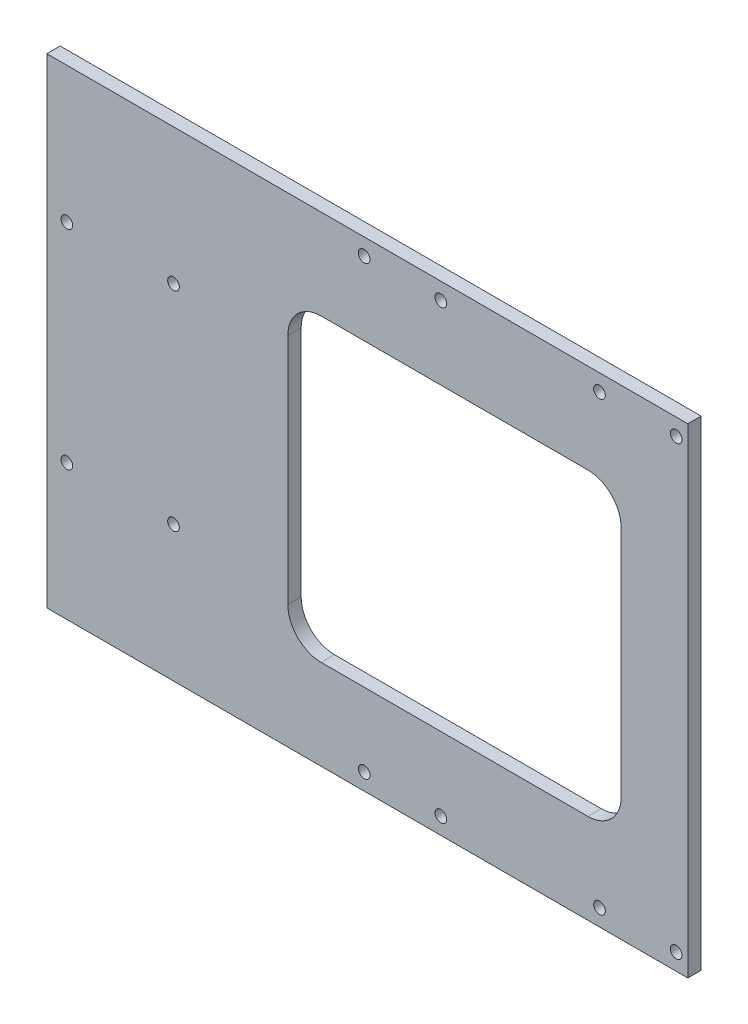
ISO-10303-21;
HEADER;
FILE_DESCRIPTION(('STEP AP214'),'2;1');
FILE_NAME('part.step','',(''),(''),'','','');
FILE_SCHEMA(('AUTOMOTIVE_DESIGN { 1 0 10303 214 1 1 1 1 }'));
ENDSEC;
DATA;
#1=APPLICATION_CONTEXT('core data for automotive mechanical design processes');
#2=APPLICATION_PROTOCOL_DEFINITION('international standard','automotive_design',2000,#1);
#3=PRODUCT_CONTEXT('',#1,'mechanical');
#4=PRODUCT('Part','Part','',(#3));
#5=PRODUCT_RELATED_PRODUCT_CATEGORY('part','',(#4));
#6=PRODUCT_DEFINITION_FORMATION('','',#4);
#7=PRODUCT_DEFINITION_CONTEXT('part definition',#1,'design');
#8=PRODUCT_DEFINITION('design','',#6,#7);
#9=PRODUCT_DEFINITION_SHAPE('','',#8);
#10=(LENGTH_UNIT() NAMED_UNIT(*) SI_UNIT(.MILLI.,.METRE.));
#11=(NAMED_UNIT(*) PLANE_ANGLE_UNIT() SI_UNIT($,.RADIAN.));
#12=(NAMED_UNIT(*) SI_UNIT($,.STERADIAN.) SOLID_ANGLE_UNIT());
#13=UNCERTAINTY_MEASURE_WITH_UNIT(LENGTH_MEASURE(1.E-05),#10,'distance_accuracy_value','');
#14=(GEOMETRIC_REPRESENTATION_CONTEXT(3) GLOBAL_UNCERTAINTY_ASSIGNED_CONTEXT((#13)) GLOBAL_UNIT_ASSIGNED_CONTEXT((#10,
#11,#12)) REPRESENTATION_CONTEXT('',''));
#15=CARTESIAN_POINT('',(0.,0.,0.));
#16=DIRECTION('',(0.,0.,1.));
#17=DIRECTION('',(1.,0.,0.));
#18=AXIS2_PLACEMENT_3D('',#15,#16,#17);
#19=CARTESIAN_POINT('',(-96.15,0.,4.));
#20=DIRECTION('',(-1.,0.,0.));
#21=DIRECTION('',(0.,0.,1.));
#22=AXIS2_PLACEMENT_3D('',#19,#20,#21);
#23=PLANE('',#22);
#24=DIRECTION('',(0.,1.,0.));
#25=VECTOR('',#24,1.);
#26=CARTESIAN_POINT('',(-96.15,0.,0.));
#27=LINE('',#26,#25);
#28=CARTESIAN_POINT('',(-96.15,-72.,0.));
#29=VERTEX_POINT('',#28);
#30=CARTESIAN_POINT('',(-96.15,72.,0.));
#31=VERTEX_POINT('',#30);
#32=EDGE_CURVE('E128',#29,#31,#27,.T.);
#33=ORIENTED_EDGE('',*,*,#32,.F.);
#34=DIRECTION('',(0.,0.,-1.));
#35=VECTOR('',#34,1.);
#36=CARTESIAN_POINT('',(-96.15,-72.,4.));
#37=LINE('',#36,#35);
#38=CARTESIAN_POINT('',(-96.15,-72.,4.));
#39=VERTEX_POINT('',#38);
#40=EDGE_CURVE('E124',#39,#29,#37,.T.);
#41=ORIENTED_EDGE('',*,*,#40,.F.);
#42=DIRECTION('',(0.,1.,0.));
#43=VECTOR('',#42,1.);
#44=CARTESIAN_POINT('',(-96.15,0.,4.));
#45=LINE('',#44,#43);
#46=CARTESIAN_POINT('',(-96.15,72.,4.));
#47=VERTEX_POINT('',#46);
#48=EDGE_CURVE('E126',#39,#47,#45,.T.);
#49=ORIENTED_EDGE('',*,*,#48,.T.);
#50=DIRECTION('',(0.,0.,-1.));
#51=VECTOR('',#50,1.);
#52=CARTESIAN_POINT('',(-96.15,72.,4.));
#53=LINE('',#52,#51);
#54=EDGE_CURVE('E172',#47,#31,#53,.T.);
#55=ORIENTED_EDGE('',*,*,#54,.T.);
#56=EDGE_LOOP('',(#33,#41,#49,#55));
#57=FACE_BOUND('',#56,.T.);
#58=ADVANCED_FACE('F34',(#57),#23,.T.);
#59=CARTESIAN_POINT('',(0.,-72.,4.));
#60=DIRECTION('',(0.,-1.,0.));
#61=DIRECTION('',(1.,0.,0.));
#62=AXIS2_PLACEMENT_3D('',#59,#60,#61);
#63=PLANE('',#62);
#64=DIRECTION('',(-1.,0.,0.));
#65=VECTOR('',#64,1.);
#66=CARTESIAN_POINT('',(0.,-72.,0.));
#67=LINE('',#66,#65);
#68=CARTESIAN_POINT('',(96.15,-72.,0.));
#69=VERTEX_POINT('',#68);
#70=EDGE_CURVE('E193',#69,#29,#67,.T.);
#71=ORIENTED_EDGE('',*,*,#70,.F.);
#72=DIRECTION('',(0.,0.,-1.));
#73=VECTOR('',#72,1.);
#74=CARTESIAN_POINT('',(96.15,-72.,4.));
#75=LINE('',#74,#73);
#76=CARTESIAN_POINT('',(96.15,-72.,4.));
#77=VERTEX_POINT('',#76);
#78=EDGE_CURVE('E134',#77,#69,#75,.T.);
#79=ORIENTED_EDGE('',*,*,#78,.F.);
#80=DIRECTION('',(-1.,0.,0.));
#81=VECTOR('',#80,1.);
#82=CARTESIAN_POINT('',(0.,-72.,4.));
#83=LINE('',#82,#81);
#84=EDGE_CURVE('E141',#77,#39,#83,.T.);
#85=ORIENTED_EDGE('',*,*,#84,.T.);
#86=ORIENTED_EDGE('',*,*,#40,.T.);
#87=EDGE_LOOP('',(#71,#79,#85,#86));
#88=FACE_BOUND('',#87,.T.);
#89=ADVANCED_FACE('F146',(#88),#63,.T.);
#90=CARTESIAN_POINT('',(96.15,0.,4.));
#91=DIRECTION('',(-1.,0.,0.));
#92=DIRECTION('',(0.,0.,1.));
#93=AXIS2_PLACEMENT_3D('',#90,#91,#92);
#94=PLANE('',#93);
#95=DIRECTION('',(0.,1.,0.));
#96=VECTOR('',#95,1.);
#97=CARTESIAN_POINT('',(96.15,0.,0.));
#98=LINE('',#97,#96);
#99=CARTESIAN_POINT('',(96.15,72.,0.));
#100=VERTEX_POINT('',#99);
#101=EDGE_CURVE('E195',#69,#100,#98,.T.);
#102=ORIENTED_EDGE('',*,*,#101,.T.);
#103=DIRECTION('',(0.,0.,-1.));
#104=VECTOR('',#103,1.);
#105=CARTESIAN_POINT('',(96.15,72.,4.));
#106=LINE('',#105,#104);
#107=CARTESIAN_POINT('',(96.15,72.,4.));
#108=VERTEX_POINT('',#107);
#109=EDGE_CURVE('E221',#108,#100,#106,.T.);
#110=ORIENTED_EDGE('',*,*,#109,.F.);
#111=DIRECTION('',(0.,1.,0.));
#112=VECTOR('',#111,1.);
#113=CARTESIAN_POINT('',(96.15,0.,4.));
#114=LINE('',#113,#112);
#115=EDGE_CURVE('E148',#77,#108,#114,.T.);
#116=ORIENTED_EDGE('',*,*,#115,.F.);
#117=ORIENTED_EDGE('',*,*,#78,.T.);
#118=EDGE_LOOP('',(#102,#110,#116,#117));
#119=FACE_BOUND('',#118,.T.);
#120=ADVANCED_FACE('F345',(#119),#94,.F.);
#121=CARTESIAN_POINT('',(92.65,-67.,4.));
#122=DIRECTION('',(0.,0.,-1.));
#123=DIRECTION('',(-1.,0.,0.));
#124=AXIS2_PLACEMENT_3D('',#121,#122,#123);
#125=CYLINDRICAL_SURFACE('',#124,1.75);
#126=CARTESIAN_POINT('',(92.65,-67.,4.));
#127=DIRECTION('',(0.,0.,1.));
#128=DIRECTION('',(1.,0.,0.));
#129=AXIS2_PLACEMENT_3D('',#126,#127,#128);
#130=CIRCLE('',#129,1.75);
#131=CARTESIAN_POINT('',(94.4,-67.,4.));
#132=VERTEX_POINT('',#131);
#133=EDGE_CURVE('E166',#132,#132,#130,.F.);
#134=ORIENTED_EDGE('',*,*,#133,.F.);
#135=EDGE_LOOP('',(#134));
#136=FACE_BOUND('',#135,.T.);
#137=CARTESIAN_POINT('',(92.65,-67.,0.));
#138=DIRECTION('',(0.,0.,1.));
#139=DIRECTION('',(1.,0.,0.));
#140=AXIS2_PLACEMENT_3D('',#137,#138,#139);
#141=CIRCLE('',#140,1.75);
#142=CARTESIAN_POINT('',(94.4,-67.,0.));
#143=VERTEX_POINT('',#142);
#144=EDGE_CURVE('E213',#143,#143,#141,.F.);
#145=ORIENTED_EDGE('',*,*,#144,.T.);
#146=EDGE_LOOP('',(#145));
#147=FACE_BOUND('',#146,.T.);
#148=ADVANCED_FACE('F530',(#136,#147),#125,.F.);
#149=CARTESIAN_POINT('',(22.05,-66.9999999999999,4.));
#150=DIRECTION('',(0.,0.,-1.));
#151=DIRECTION('',(-1.,0.,0.));
#152=AXIS2_PLACEMENT_3D('',#149,#150,#151);
#153=CYLINDRICAL_SURFACE('',#152,1.75);
#154=CARTESIAN_POINT('',(22.05,-66.9999999999999,4.));
#155=DIRECTION('',(0.,0.,1.));
#156=DIRECTION('',(1.,0.,0.));
#157=AXIS2_PLACEMENT_3D('',#154,#155,#156);
#158=CIRCLE('',#157,1.75);
#159=CARTESIAN_POINT('',(23.8,-66.9999999999999,4.));
#160=VERTEX_POINT('',#159);
#161=EDGE_CURVE('E163',#160,#160,#158,.F.);
#162=ORIENTED_EDGE('',*,*,#161,.F.);
#163=EDGE_LOOP('',(#162));
#164=FACE_BOUND('',#163,.T.);
#165=CARTESIAN_POINT('',(22.05,-66.9999999999999,0.));
#166=DIRECTION('',(0.,0.,1.));
#167=DIRECTION('',(1.,0.,0.));
#168=AXIS2_PLACEMENT_3D('',#165,#166,#167);
#169=CIRCLE('',#168,1.75);
#170=CARTESIAN_POINT('',(23.8,-66.9999999999999,0.));
#171=VERTEX_POINT('',#170);
#172=EDGE_CURVE('E210',#171,#171,#169,.F.);
#173=ORIENTED_EDGE('',*,*,#172,.T.);
#174=EDGE_LOOP('',(#173));
#175=FACE_BOUND('',#174,.T.);
#176=ADVANCED_FACE('F520',(#164,#175),#153,.F.);
#177=CARTESIAN_POINT('',(-0.950000000000013,-66.9999999999999,4.));
#178=DIRECTION('',(0.,0.,-1.));
#179=DIRECTION('',(-1.,0.,0.));
#180=AXIS2_PLACEMENT_3D('',#177,#178,#179);
#181=CYLINDRICAL_SURFACE('',#180,1.75);
#182=CARTESIAN_POINT('',(-0.950000000000013,-66.9999999999999,4.));
#183=DIRECTION('',(0.,0.,1.));
#184=DIRECTION('',(1.,0.,0.));
#185=AXIS2_PLACEMENT_3D('',#182,#183,#184);
#186=CIRCLE('',#185,1.75);
#187=CARTESIAN_POINT('',(0.799999999999988,-66.9999999999999,4.));
#188=VERTEX_POINT('',#187);
#189=EDGE_CURVE('E160',#188,#188,#186,.F.);
#190=ORIENTED_EDGE('',*,*,#189,.F.);
#191=EDGE_LOOP('',(#190));
#192=FACE_BOUND('',#191,.T.);
#193=CARTESIAN_POINT('',(-0.950000000000013,-66.9999999999999,0.));
#194=DIRECTION('',(0.,0.,1.));
#195=DIRECTION('',(1.,0.,0.));
#196=AXIS2_PLACEMENT_3D('',#193,#194,#195);
#197=CIRCLE('',#196,1.75);
#198=CARTESIAN_POINT('',(0.799999999999988,-66.9999999999999,0.));
#199=VERTEX_POINT('',#198);
#200=EDGE_CURVE('E207',#199,#199,#197,.F.);
#201=ORIENTED_EDGE('',*,*,#200,.T.);
#202=EDGE_LOOP('',(#201));
#203=FACE_BOUND('',#202,.T.);
#204=ADVANCED_FACE('F510',(#192,#203),#181,.F.);
#205=CARTESIAN_POINT('',(69.65,-67.,4.));
#206=DIRECTION('',(0.,0.,-1.));
#207=DIRECTION('',(-1.,0.,0.));
#208=AXIS2_PLACEMENT_3D('',#205,#206,#207);
#209=CYLINDRICAL_SURFACE('',#208,1.75);
#210=CARTESIAN_POINT('',(69.65,-67.,4.));
#211=DIRECTION('',(0.,0.,1.));
#212=DIRECTION('',(1.,0.,0.));
#213=AXIS2_PLACEMENT_3D('',#210,#211,#212);
#214=CIRCLE('',#213,1.75);
#215=CARTESIAN_POINT('',(71.4,-67.,4.));
#216=VERTEX_POINT('',#215);
#217=EDGE_CURVE('E157',#216,#216,#214,.F.);
#218=ORIENTED_EDGE('',*,*,#217,.F.);
#219=EDGE_LOOP('',(#218));
#220=FACE_BOUND('',#219,.T.);
#221=CARTESIAN_POINT('',(69.65,-67.,0.));
#222=DIRECTION('',(0.,0.,1.));
#223=DIRECTION('',(1.,0.,0.));
#224=AXIS2_PLACEMENT_3D('',#221,#222,#223);
#225=CIRCLE('',#224,1.75);
#226=CARTESIAN_POINT('',(71.4,-67.,0.));
#227=VERTEX_POINT('',#226);
#228=EDGE_CURVE('E204',#227,#227,#225,.F.);
#229=ORIENTED_EDGE('',*,*,#228,.T.);
#230=EDGE_LOOP('',(#229));
#231=FACE_BOUND('',#230,.T.);
#232=ADVANCED_FACE('F500',(#220,#231),#209,.F.);
#233=CARTESIAN_POINT('',(-90.15,-31.25,4.));
#234=DIRECTION('',(0.,0.,-1.));
#235=DIRECTION('',(-1.,0.,0.));
#236=AXIS2_PLACEMENT_3D('',#233,#234,#235);
#237=CYLINDRICAL_SURFACE('',#236,1.75);
#238=CARTESIAN_POINT('',(-90.15,-31.25,4.));
#239=DIRECTION('',(0.,0.,1.));
#240=DIRECTION('',(1.,0.,0.));
#241=AXIS2_PLACEMENT_3D('',#238,#239,#240);
#242=CIRCLE('',#241,1.75);
#243=CARTESIAN_POINT('',(-88.4,-31.25,4.));
#244=VERTEX_POINT('',#243);
#245=EDGE_CURVE('E154',#244,#244,#242,.F.);
#246=ORIENTED_EDGE('',*,*,#245,.F.);
#247=EDGE_LOOP('',(#246));
#248=FACE_BOUND('',#247,.T.);
#249=CARTESIAN_POINT('',(-90.15,-31.25,0.));
#250=DIRECTION('',(0.,0.,1.));
#251=DIRECTION('',(1.,0.,0.));
#252=AXIS2_PLACEMENT_3D('',#249,#250,#251);
#253=CIRCLE('',#252,1.75);
#254=CARTESIAN_POINT('',(-88.4,-31.25,0.));
#255=VERTEX_POINT('',#254);
#256=EDGE_CURVE('E201',#255,#255,#253,.F.);
#257=ORIENTED_EDGE('',*,*,#256,.T.);
#258=EDGE_LOOP('',(#257));
#259=FACE_BOUND('',#258,.T.);
#260=ADVANCED_FACE('F490',(#248,#259),#237,.F.);
#261=CARTESIAN_POINT('',(0.,72.,4.));
#262=DIRECTION('',(0.,-1.,0.));
#263=DIRECTION('',(1.,0.,0.));
#264=AXIS2_PLACEMENT_3D('',#261,#262,#263);
#265=PLANE('',#264);
#266=DIRECTION('',(-1.,0.,0.));
#267=VECTOR('',#266,1.);
#268=CARTESIAN_POINT('',(0.,72.,0.));
#269=LINE('',#268,#267);
#270=EDGE_CURVE('E198',#100,#31,#269,.T.);
#271=ORIENTED_EDGE('',*,*,#270,.T.);
#272=ORIENTED_EDGE('',*,*,#54,.F.);
#273=DIRECTION('',(-1.,0.,0.));
#274=VECTOR('',#273,1.);
#275=CARTESIAN_POINT('',(0.,72.,4.));
#276=LINE('',#275,#274);
#277=EDGE_CURVE('E142',#108,#47,#276,.T.);
#278=ORIENTED_EDGE('',*,*,#277,.F.);
#279=ORIENTED_EDGE('',*,*,#109,.T.);
#280=EDGE_LOOP('',(#271,#272,#278,#279));
#281=FACE_BOUND('',#280,.T.);
#282=ADVANCED_FACE('F352',(#281),#265,.F.);
#283=CARTESIAN_POINT('',(92.65,67.,4.));
#284=DIRECTION('',(0.,0.,-1.));
#285=DIRECTION('',(-1.,0.,0.));
#286=AXIS2_PLACEMENT_3D('',#283,#284,#285);
#287=CYLINDRICAL_SURFACE('',#286,1.75);
#288=CARTESIAN_POINT('',(92.65,67.,4.));
#289=DIRECTION('',(0.,0.,1.));
#290=DIRECTION('',(1.,0.,0.));
#291=AXIS2_PLACEMENT_3D('',#288,#289,#290);
#292=CIRCLE('',#291,1.75);
#293=CARTESIAN_POINT('',(94.4,67.,4.));
#294=VERTEX_POINT('',#293);
#295=EDGE_CURVE('E144',#294,#294,#292,.T.);
#296=ORIENTED_EDGE('',*,*,#295,.T.);
#297=EDGE_LOOP('',(#296));
#298=FACE_BOUND('',#297,.T.);
#299=CARTESIAN_POINT('',(92.65,67.,0.));
#300=DIRECTION('',(0.,0.,1.));
#301=DIRECTION('',(1.,0.,0.));
#302=AXIS2_PLACEMENT_3D('',#299,#300,#301);
#303=CIRCLE('',#302,1.75);
#304=CARTESIAN_POINT('',(94.4,67.,0.));
#305=VERTEX_POINT('',#304);
#306=EDGE_CURVE('E189',#305,#305,#303,.T.);
#307=ORIENTED_EDGE('',*,*,#306,.F.);
#308=EDGE_LOOP('',(#307));
#309=FACE_BOUND('',#308,.T.);
#310=ADVANCED_FACE('F325',(#298,#309),#287,.F.);
#311=CARTESIAN_POINT('',(69.65,67.,4.));
#312=DIRECTION('',(0.,0.,-1.));
#313=DIRECTION('',(-1.,0.,0.));
#314=AXIS2_PLACEMENT_3D('',#311,#312,#313);
#315=CYLINDRICAL_SURFACE('',#314,1.75);
#316=CARTESIAN_POINT('',(69.65,67.,4.));
#317=DIRECTION('',(0.,0.,1.));
#318=DIRECTION('',(1.,0.,0.));
#319=AXIS2_PLACEMENT_3D('',#316,#317,#318);
#320=CIRCLE('',#319,1.75);
#321=CARTESIAN_POINT('',(71.4,67.,4.));
#322=VERTEX_POINT('',#321);
#323=EDGE_CURVE('E320',#322,#322,#320,.T.);
#324=ORIENTED_EDGE('',*,*,#323,.T.);
#325=EDGE_LOOP('',(#324));
#326=FACE_BOUND('',#325,.T.);
#327=CARTESIAN_POINT('',(69.65,67.,0.));
#328=DIRECTION('',(0.,0.,1.));
#329=DIRECTION('',(1.,0.,0.));
#330=AXIS2_PLACEMENT_3D('',#327,#328,#329);
#331=CIRCLE('',#330,1.75);
#332=CARTESIAN_POINT('',(71.4,67.,0.));
#333=VERTEX_POINT('',#332);
#334=EDGE_CURVE('E186',#333,#333,#331,.T.);
#335=ORIENTED_EDGE('',*,*,#334,.F.);
#336=EDGE_LOOP('',(#335));
#337=FACE_BOUND('',#336,.T.);
#338=ADVANCED_FACE('F351',(#326,#337),#315,.F.);
#339=CARTESIAN_POINT('',(22.05,66.9999999999999,4.));
#340=DIRECTION('',(0.,0.,-1.));
#341=DIRECTION('',(-1.,0.,0.));
#342=AXIS2_PLACEMENT_3D('',#339,#340,#341);
#343=CYLINDRICAL_SURFACE('',#342,1.75);
#344=CARTESIAN_POINT('',(22.05,66.9999999999999,4.));
#345=DIRECTION('',(0.,0.,1.));
#346=DIRECTION('',(1.,0.,0.));
#347=AXIS2_PLACEMENT_3D('',#344,#345,#346);
#348=CIRCLE('',#347,1.75);
#349=CARTESIAN_POINT('',(23.8,66.9999999999999,4.));
#350=VERTEX_POINT('',#349);
#351=EDGE_CURVE('E317',#350,#350,#348,.T.);
#352=ORIENTED_EDGE('',*,*,#351,.T.);
#353=EDGE_LOOP('',(#352));
#354=FACE_BOUND('',#353,.T.);
#355=CARTESIAN_POINT('',(22.05,66.9999999999999,0.));
#356=DIRECTION('',(0.,0.,1.));
#357=DIRECTION('',(1.,0.,0.));
#358=AXIS2_PLACEMENT_3D('',#355,#356,#357);
#359=CIRCLE('',#358,1.75);
#360=CARTESIAN_POINT('',(23.8,66.9999999999999,0.));
#361=VERTEX_POINT('',#360);
#362=EDGE_CURVE('E183',#361,#361,#359,.T.);
#363=ORIENTED_EDGE('',*,*,#362,.F.);
#364=EDGE_LOOP('',(#363));
#365=FACE_BOUND('',#364,.T.);
#366=ADVANCED_FACE('F355',(#354,#365),#343,.F.);
#367=CARTESIAN_POINT('',(-0.950000000000013,66.9999999999999,4.));
#368=DIRECTION('',(0.,0.,-1.));
#369=DIRECTION('',(-1.,0.,0.));
#370=AXIS2_PLACEMENT_3D('',#367,#368,#369);
#371=CYLINDRICAL_SURFACE('',#370,1.75);
#372=CARTESIAN_POINT('',(-0.950000000000013,66.9999999999999,4.));
#373=DIRECTION('',(0.,0.,1.));
#374=DIRECTION('',(1.,0.,0.));
#375=AXIS2_PLACEMENT_3D('',#372,#373,#374);
#376=CIRCLE('',#375,1.75);
#377=CARTESIAN_POINT('',(0.799999999999988,66.9999999999999,4.));
#378=VERTEX_POINT('',#377);
#379=EDGE_CURVE('E314',#378,#378,#376,.T.);
#380=ORIENTED_EDGE('',*,*,#379,.T.);
#381=EDGE_LOOP('',(#380));
#382=FACE_BOUND('',#381,.T.);
#383=CARTESIAN_POINT('',(-0.950000000000013,66.9999999999999,0.));
#384=DIRECTION('',(0.,0.,1.));
#385=DIRECTION('',(1.,0.,0.));
#386=AXIS2_PLACEMENT_3D('',#383,#384,#385);
#387=CIRCLE('',#386,1.75);
#388=CARTESIAN_POINT('',(0.799999999999988,66.9999999999999,0.));
#389=VERTEX_POINT('',#388);
#390=EDGE_CURVE('E180',#389,#389,#387,.T.);
#391=ORIENTED_EDGE('',*,*,#390,.F.);
#392=EDGE_LOOP('',(#391));
#393=FACE_BOUND('',#392,.T.);
#394=ADVANCED_FACE('F359',(#382,#393),#371,.F.);
#395=CARTESIAN_POINT('',(-90.15,31.25,4.));
#396=DIRECTION('',(0.,0.,-1.));
#397=DIRECTION('',(-1.,0.,0.));
#398=AXIS2_PLACEMENT_3D('',#395,#396,#397);
#399=CYLINDRICAL_SURFACE('',#398,1.75);
#400=CARTESIAN_POINT('',(-90.15,31.25,4.));
#401=DIRECTION('',(0.,0.,1.));
#402=DIRECTION('',(1.,0.,0.));
#403=AXIS2_PLACEMENT_3D('',#400,#401,#402);
#404=CIRCLE('',#403,1.75);
#405=CARTESIAN_POINT('',(-88.4,31.25,4.));
#406=VERTEX_POINT('',#405);
#407=EDGE_CURVE('E311',#406,#406,#404,.T.);
#408=ORIENTED_EDGE('',*,*,#407,.T.);
#409=EDGE_LOOP('',(#408));
#410=FACE_BOUND('',#409,.T.);
#411=CARTESIAN_POINT('',(-90.15,31.25,0.));
#412=DIRECTION('',(0.,0.,1.));
#413=DIRECTION('',(1.,0.,0.));
#414=AXIS2_PLACEMENT_3D('',#411,#412,#413);
#415=CIRCLE('',#414,1.75);
#416=CARTESIAN_POINT('',(-88.4,31.25,0.));
#417=VERTEX_POINT('',#416);
#418=EDGE_CURVE('E176',#417,#417,#415,.T.);
#419=ORIENTED_EDGE('',*,*,#418,.F.);
#420=EDGE_LOOP('',(#419));
#421=FACE_BOUND('',#420,.T.);
#422=ADVANCED_FACE('F363',(#410,#421),#399,.F.);
#423=CARTESIAN_POINT('',(-58.15,31.25,4.));
#424=DIRECTION('',(0.,0.,-1.));
#425=DIRECTION('',(-1.,0.,0.));
#426=AXIS2_PLACEMENT_3D('',#423,#424,#425);
#427=CYLINDRICAL_SURFACE('',#426,1.75);
#428=CARTESIAN_POINT('',(-58.15,31.25,4.));
#429=DIRECTION('',(0.,0.,1.));
#430=DIRECTION('',(1.,0.,0.));
#431=AXIS2_PLACEMENT_3D('',#428,#429,#430);
#432=CIRCLE('',#431,1.75);
#433=CARTESIAN_POINT('',(-56.4,31.25,4.));
#434=VERTEX_POINT('',#433);
#435=EDGE_CURVE('E219',#434,#434,#432,.T.);
#436=ORIENTED_EDGE('',*,*,#435,.T.);
#437=EDGE_LOOP('',(#436));
#438=FACE_BOUND('',#437,.T.);
#439=CARTESIAN_POINT('',(-58.15,31.25,0.));
#440=DIRECTION('',(0.,0.,1.));
#441=DIRECTION('',(1.,0.,0.));
#442=AXIS2_PLACEMENT_3D('',#439,#440,#441);
#443=CIRCLE('',#442,1.75);
#444=CARTESIAN_POINT('',(-56.4,31.25,0.));
#445=VERTEX_POINT('',#444);
#446=EDGE_CURVE('E173',#445,#445,#443,.T.);
#447=ORIENTED_EDGE('',*,*,#446,.F.);
#448=EDGE_LOOP('',(#447));
#449=FACE_BOUND('',#448,.T.);
#450=ADVANCED_FACE('F336',(#438,#449),#427,.F.);
#451=CARTESIAN_POINT('',(-58.15,-31.25,4.));
#452=DIRECTION('',(0.,0.,-1.));
#453=DIRECTION('',(-1.,0.,0.));
#454=AXIS2_PLACEMENT_3D('',#451,#452,#453);
#455=CYLINDRICAL_SURFACE('',#454,1.75000000000001);
#456=CARTESIAN_POINT('',(-58.15,-31.25,4.));
#457=DIRECTION('',(0.,0.,1.));
#458=DIRECTION('',(1.,0.,0.));
#459=AXIS2_PLACEMENT_3D('',#456,#457,#458);
#460=CIRCLE('',#459,1.75000000000001);
#461=CARTESIAN_POINT('',(-56.4,-31.25,4.));
#462=VERTEX_POINT('',#461);
#463=EDGE_CURVE('E169',#462,#462,#460,.F.);
#464=ORIENTED_EDGE('',*,*,#463,.F.);
#465=EDGE_LOOP('',(#464));
#466=FACE_BOUND('',#465,.T.);
#467=CARTESIAN_POINT('',(-58.15,-31.25,0.));
#468=DIRECTION('',(0.,0.,1.));
#469=DIRECTION('',(1.,0.,0.));
#470=AXIS2_PLACEMENT_3D('',#467,#468,#469);
#471=CIRCLE('',#470,1.75000000000001);
#472=CARTESIAN_POINT('',(-56.4,-31.25,0.));
#473=VERTEX_POINT('',#472);
#474=EDGE_CURVE('E216',#473,#473,#471,.F.);
#475=ORIENTED_EDGE('',*,*,#474,.T.);
#476=EDGE_LOOP('',(#475));
#477=FACE_BOUND('',#476,.T.);
#478=ADVANCED_FACE('F329',(#466,#477),#455,.F.);
#479=CARTESIAN_POINT('',(0.,0.,4.));
#480=DIRECTION('',(0.,0.,1.));
#481=DIRECTION('',(1.,0.,0.));
#482=AXIS2_PLACEMENT_3D('',#479,#480,#481);
#483=PLANE('',#482);
#484=DIRECTION('',(0.,-1.,0.));
#485=VECTOR('',#484,1.);
#486=CARTESIAN_POINT('',(-23.85,-45.,4.));
#487=LINE('',#486,#485);
#488=CARTESIAN_POINT('',(-23.85,35.,4.));
#489=VERTEX_POINT('',#488);
#490=CARTESIAN_POINT('',(-23.85,-35.,4.));
#491=VERTEX_POINT('',#490);
#492=EDGE_CURVE('E268',#489,#491,#487,.T.);
#493=ORIENTED_EDGE('',*,*,#492,.F.);
#494=CARTESIAN_POINT('',(-13.85,35.,4.));
#495=DIRECTION('',(0.,0.,1.));
#496=DIRECTION('',(1.,0.,0.));
#497=AXIS2_PLACEMENT_3D('',#494,#495,#496);
#498=CIRCLE('',#497,10.);
#499=CARTESIAN_POINT('',(-13.85,45.,4.));
#500=VERTEX_POINT('',#499);
#501=EDGE_CURVE('E42',#489,#500,#498,.F.);
#502=ORIENTED_EDGE('',*,*,#501,.T.);
#503=DIRECTION('',(-1.,0.,0.));
#504=VECTOR('',#503,1.);
#505=CARTESIAN_POINT('',(76.15,45.,4.));
#506=LINE('',#505,#504);
#507=CARTESIAN_POINT('',(66.15,45.,4.));
#508=VERTEX_POINT('',#507);
#509=EDGE_CURVE('E177',#508,#500,#506,.T.);
#510=ORIENTED_EDGE('',*,*,#509,.F.);
#511=CARTESIAN_POINT('',(66.15,35.,4.));
#512=DIRECTION('',(0.,0.,1.));
#513=DIRECTION('',(1.,0.,0.));
#514=AXIS2_PLACEMENT_3D('',#511,#512,#513);
#515=CIRCLE('',#514,10.);
#516=CARTESIAN_POINT('',(76.15,35.,4.));
#517=VERTEX_POINT('',#516);
#518=EDGE_CURVE('E261',#508,#517,#515,.F.);
#519=ORIENTED_EDGE('',*,*,#518,.T.);
#520=DIRECTION('',(0.,1.,0.));
#521=VECTOR('',#520,1.);
#522=CARTESIAN_POINT('',(76.15,-45.,4.));
#523=LINE('',#522,#521);
#524=CARTESIAN_POINT('',(76.15,-35.,4.));
#525=VERTEX_POINT('',#524);
#526=EDGE_CURVE('E273',#525,#517,#523,.T.);
#527=ORIENTED_EDGE('',*,*,#526,.F.);
#528=CARTESIAN_POINT('',(66.15,-35.,4.));
#529=DIRECTION('',(0.,0.,1.));
#530=DIRECTION('',(1.,0.,0.));
#531=AXIS2_PLACEMENT_3D('',#528,#529,#530);
#532=CIRCLE('',#531,10.);
#533=CARTESIAN_POINT('',(66.15,-45.,4.));
#534=VERTEX_POINT('',#533);
#535=EDGE_CURVE('E257',#525,#534,#532,.F.);
#536=ORIENTED_EDGE('',*,*,#535,.T.);
#537=DIRECTION('',(1.,0.,0.));
#538=VECTOR('',#537,1.);
#539=CARTESIAN_POINT('',(76.15,-45.,4.));
#540=LINE('',#539,#538);
#541=CARTESIAN_POINT('',(-13.85,-45.,4.));
#542=VERTEX_POINT('',#541);
#543=EDGE_CURVE('E293',#542,#534,#540,.T.);
#544=ORIENTED_EDGE('',*,*,#543,.F.);
#545=CARTESIAN_POINT('',(-13.85,-35.,4.));
#546=DIRECTION('',(0.,0.,1.));
#547=DIRECTION('',(1.,0.,0.));
#548=AXIS2_PLACEMENT_3D('',#545,#546,#547);
#549=CIRCLE('',#548,10.);
#550=EDGE_CURVE('E253',#542,#491,#549,.F.);
#551=ORIENTED_EDGE('',*,*,#550,.T.);
#552=EDGE_LOOP('',(#493,#502,#510,#519,#527,#536,#544,#551));
#553=FACE_BOUND('',#552,.T.);
#554=ORIENTED_EDGE('',*,*,#435,.F.);
#555=EDGE_LOOP('',(#554));
#556=FACE_BOUND('',#555,.T.);
#557=ORIENTED_EDGE('',*,*,#407,.F.);
#558=EDGE_LOOP('',(#557));
#559=FACE_BOUND('',#558,.T.);
#560=ORIENTED_EDGE('',*,*,#379,.F.);
#561=EDGE_LOOP('',(#560));
#562=FACE_BOUND('',#561,.T.);
#563=ORIENTED_EDGE('',*,*,#351,.F.);
#564=EDGE_LOOP('',(#563));
#565=FACE_BOUND('',#564,.T.);
#566=ORIENTED_EDGE('',*,*,#323,.F.);
#567=EDGE_LOOP('',(#566));
#568=FACE_BOUND('',#567,.T.);
#569=ORIENTED_EDGE('',*,*,#295,.F.);
#570=EDGE_LOOP('',(#569));
#571=FACE_BOUND('',#570,.T.);
#572=ORIENTED_EDGE('',*,*,#48,.F.);
#573=ORIENTED_EDGE('',*,*,#84,.F.);
#574=ORIENTED_EDGE('',*,*,#115,.T.);
#575=ORIENTED_EDGE('',*,*,#277,.T.);
#576=EDGE_LOOP('',(#572,#573,#574,#575));
#577=FACE_BOUND('',#576,.T.);
#578=ORIENTED_EDGE('',*,*,#245,.T.);
#579=EDGE_LOOP('',(#578));
#580=FACE_BOUND('',#579,.T.);
#581=ORIENTED_EDGE('',*,*,#217,.T.);
#582=EDGE_LOOP('',(#581));
#583=FACE_BOUND('',#582,.T.);
#584=ORIENTED_EDGE('',*,*,#189,.T.);
#585=EDGE_LOOP('',(#584));
#586=FACE_BOUND('',#585,.T.);
#587=ORIENTED_EDGE('',*,*,#161,.T.);
#588=EDGE_LOOP('',(#587));
#589=FACE_BOUND('',#588,.T.);
#590=ORIENTED_EDGE('',*,*,#133,.T.);
#591=EDGE_LOOP('',(#590));
#592=FACE_BOUND('',#591,.T.);
#593=ORIENTED_EDGE('',*,*,#463,.T.);
#594=EDGE_LOOP('',(#593));
#595=FACE_BOUND('',#594,.T.);
#596=ADVANCED_FACE('F138',(#553,#556,#559,#562,#565,#568,#571,#577,#580,#583,#586,#589,#592,
#595),#483,.T.);
#597=CARTESIAN_POINT('',(0.,0.,0.));
#598=DIRECTION('',(0.,0.,1.));
#599=DIRECTION('',(1.,0.,0.));
#600=AXIS2_PLACEMENT_3D('',#597,#598,#599);
#601=PLANE('',#600);
#602=DIRECTION('',(0.,1.,0.));
#603=VECTOR('',#602,1.);
#604=CARTESIAN_POINT('',(76.15,0.,0.));
#605=LINE('',#604,#603);
#606=CARTESIAN_POINT('',(76.15,-35.,0.));
#607=VERTEX_POINT('',#606);
#608=CARTESIAN_POINT('',(76.15,35.,0.));
#609=VERTEX_POINT('',#608);
#610=EDGE_CURVE('E227',#607,#609,#605,.T.);
#611=ORIENTED_EDGE('',*,*,#610,.T.);
#612=CARTESIAN_POINT('',(66.15,35.,0.));
#613=DIRECTION('',(0.,0.,1.));
#614=DIRECTION('',(1.,0.,0.));
#615=AXIS2_PLACEMENT_3D('',#612,#613,#614);
#616=CIRCLE('',#615,10.);
#617=CARTESIAN_POINT('',(66.15,45.,0.));
#618=VERTEX_POINT('',#617);
#619=EDGE_CURVE('E56',#609,#618,#616,.T.);
#620=ORIENTED_EDGE('',*,*,#619,.T.);
#621=DIRECTION('',(-1.,0.,0.));
#622=VECTOR('',#621,1.);
#623=CARTESIAN_POINT('',(0.,45.,0.));
#624=LINE('',#623,#622);
#625=CARTESIAN_POINT('',(-13.85,45.,0.));
#626=VERTEX_POINT('',#625);
#627=EDGE_CURVE('E229',#618,#626,#624,.T.);
#628=ORIENTED_EDGE('',*,*,#627,.T.);
#629=CARTESIAN_POINT('',(-13.85,35.,0.));
#630=DIRECTION('',(0.,0.,1.));
#631=DIRECTION('',(1.,0.,0.));
#632=AXIS2_PLACEMENT_3D('',#629,#630,#631);
#633=CIRCLE('',#632,10.);
#634=CARTESIAN_POINT('',(-23.85,35.,0.));
#635=VERTEX_POINT('',#634);
#636=EDGE_CURVE('E11',#626,#635,#633,.T.);
#637=ORIENTED_EDGE('',*,*,#636,.T.);
#638=DIRECTION('',(0.,-1.,0.));
#639=VECTOR('',#638,1.);
#640=CARTESIAN_POINT('',(-23.85,0.,0.));
#641=LINE('',#640,#639);
#642=CARTESIAN_POINT('',(-23.85,-35.,0.));
#643=VERTEX_POINT('',#642);
#644=EDGE_CURVE('E231',#635,#643,#641,.T.);
#645=ORIENTED_EDGE('',*,*,#644,.T.);
#646=CARTESIAN_POINT('',(-13.85,-35.,0.));
#647=DIRECTION('',(0.,0.,1.));
#648=DIRECTION('',(1.,0.,0.));
#649=AXIS2_PLACEMENT_3D('',#646,#647,#648);
#650=CIRCLE('',#649,10.);
#651=CARTESIAN_POINT('',(-13.85,-45.,0.));
#652=VERTEX_POINT('',#651);
#653=EDGE_CURVE('E255',#643,#652,#650,.T.);
#654=ORIENTED_EDGE('',*,*,#653,.T.);
#655=DIRECTION('',(1.,0.,0.));
#656=VECTOR('',#655,1.);
#657=CARTESIAN_POINT('',(0.,-45.,0.));
#658=LINE('',#657,#656);
#659=CARTESIAN_POINT('',(66.15,-45.,0.));
#660=VERTEX_POINT('',#659);
#661=EDGE_CURVE('E133',#652,#660,#658,.T.);
#662=ORIENTED_EDGE('',*,*,#661,.T.);
#663=CARTESIAN_POINT('',(66.15,-35.,0.));
#664=DIRECTION('',(0.,0.,1.));
#665=DIRECTION('',(1.,0.,0.));
#666=AXIS2_PLACEMENT_3D('',#663,#664,#665);
#667=CIRCLE('',#666,10.);
#668=EDGE_CURVE('E259',#660,#607,#667,.T.);
#669=ORIENTED_EDGE('',*,*,#668,.T.);
#670=EDGE_LOOP('',(#611,#620,#628,#637,#645,#654,#662,#669));
#671=FACE_BOUND('',#670,.T.);
#672=ORIENTED_EDGE('',*,*,#446,.T.);
#673=EDGE_LOOP('',(#672));
#674=FACE_BOUND('',#673,.T.);
#675=ORIENTED_EDGE('',*,*,#418,.T.);
#676=EDGE_LOOP('',(#675));
#677=FACE_BOUND('',#676,.T.);
#678=ORIENTED_EDGE('',*,*,#390,.T.);
#679=EDGE_LOOP('',(#678));
#680=FACE_BOUND('',#679,.T.);
#681=ORIENTED_EDGE('',*,*,#362,.T.);
#682=EDGE_LOOP('',(#681));
#683=FACE_BOUND('',#682,.T.);
#684=ORIENTED_EDGE('',*,*,#334,.T.);
#685=EDGE_LOOP('',(#684));
#686=FACE_BOUND('',#685,.T.);
#687=ORIENTED_EDGE('',*,*,#306,.T.);
#688=EDGE_LOOP('',(#687));
#689=FACE_BOUND('',#688,.T.);
#690=ORIENTED_EDGE('',*,*,#32,.T.);
#691=ORIENTED_EDGE('',*,*,#270,.F.);
#692=ORIENTED_EDGE('',*,*,#101,.F.);
#693=ORIENTED_EDGE('',*,*,#70,.T.);
#694=EDGE_LOOP('',(#690,#691,#692,#693));
#695=FACE_BOUND('',#694,.T.);
#696=ORIENTED_EDGE('',*,*,#256,.F.);
#697=EDGE_LOOP('',(#696));
#698=FACE_BOUND('',#697,.T.);
#699=ORIENTED_EDGE('',*,*,#228,.F.);
#700=EDGE_LOOP('',(#699));
#701=FACE_BOUND('',#700,.T.);
#702=ORIENTED_EDGE('',*,*,#200,.F.);
#703=EDGE_LOOP('',(#702));
#704=FACE_BOUND('',#703,.T.);
#705=ORIENTED_EDGE('',*,*,#172,.F.);
#706=EDGE_LOOP('',(#705));
#707=FACE_BOUND('',#706,.T.);
#708=ORIENTED_EDGE('',*,*,#144,.F.);
#709=EDGE_LOOP('',(#708));
#710=FACE_BOUND('',#709,.T.);
#711=ORIENTED_EDGE('',*,*,#474,.F.);
#712=EDGE_LOOP('',(#711));
#713=FACE_BOUND('',#712,.T.);
#714=ADVANCED_FACE('F277',(#671,#674,#677,#680,#683,#686,#689,#695,#698,#701,#704,#707,#710,
#713),#601,.F.);
#715=CARTESIAN_POINT('',(-23.85,-45.,-6.));
#716=DIRECTION('',(-1.,0.,0.));
#717=DIRECTION('',(0.,0.,1.));
#718=AXIS2_PLACEMENT_3D('',#715,#716,#717);
#719=PLANE('',#718);
#720=ORIENTED_EDGE('',*,*,#492,.T.);
#721=DIRECTION('',(0.,0.,1.));
#722=VECTOR('',#721,1.);
#723=CARTESIAN_POINT('',(-23.85,-35.,0.));
#724=LINE('',#723,#722);
#725=EDGE_CURVE('E242',#491,#643,#724,.F.);
#726=ORIENTED_EDGE('',*,*,#725,.T.);
#727=ORIENTED_EDGE('',*,*,#644,.F.);
#728=DIRECTION('',(0.,0.,1.));
#729=VECTOR('',#728,1.);
#730=CARTESIAN_POINT('',(-23.85,35.,4.));
#731=LINE('',#730,#729);
#732=EDGE_CURVE('E239',#635,#489,#731,.T.);
#733=ORIENTED_EDGE('',*,*,#732,.T.);
#734=EDGE_LOOP('',(#720,#726,#727,#733));
#735=FACE_BOUND('',#734,.T.);
#736=ADVANCED_FACE('F281',(#735),#719,.F.);
#737=CARTESIAN_POINT('',(76.15,45.,-6.));
#738=DIRECTION('',(0.,1.,0.));
#739=DIRECTION('',(-1.,0.,0.));
#740=AXIS2_PLACEMENT_3D('',#737,#738,#739);
#741=PLANE('',#740);
#742=ORIENTED_EDGE('',*,*,#627,.F.);
#743=DIRECTION('',(0.,0.,1.));
#744=VECTOR('',#743,1.);
#745=CARTESIAN_POINT('',(66.15,45.,4.));
#746=LINE('',#745,#744);
#747=EDGE_CURVE('E250',#618,#508,#746,.T.);
#748=ORIENTED_EDGE('',*,*,#747,.T.);
#749=ORIENTED_EDGE('',*,*,#509,.T.);
#750=DIRECTION('',(0.,0.,1.));
#751=VECTOR('',#750,1.);
#752=CARTESIAN_POINT('',(-13.85,45.,0.));
#753=LINE('',#752,#751);
#754=EDGE_CURVE('E49',#500,#626,#753,.F.);
#755=ORIENTED_EDGE('',*,*,#754,.T.);
#756=EDGE_LOOP('',(#742,#748,#749,#755));
#757=FACE_BOUND('',#756,.T.);
#758=ADVANCED_FACE('F271',(#757),#741,.F.);
#759=CARTESIAN_POINT('',(76.15,-45.,-6.));
#760=DIRECTION('',(1.,0.,0.));
#761=DIRECTION('',(0.,0.,-1.));
#762=AXIS2_PLACEMENT_3D('',#759,#760,#761);
#763=PLANE('',#762);
#764=ORIENTED_EDGE('',*,*,#610,.F.);
#765=DIRECTION('',(0.,0.,1.));
#766=VECTOR('',#765,1.);
#767=CARTESIAN_POINT('',(76.15,-35.,4.));
#768=LINE('',#767,#766);
#769=EDGE_CURVE('E246',#607,#525,#768,.T.);
#770=ORIENTED_EDGE('',*,*,#769,.T.);
#771=ORIENTED_EDGE('',*,*,#526,.T.);
#772=DIRECTION('',(0.,0.,1.));
#773=VECTOR('',#772,1.);
#774=CARTESIAN_POINT('',(76.15,35.,0.));
#775=LINE('',#774,#773);
#776=EDGE_CURVE('E244',#517,#609,#775,.F.);
#777=ORIENTED_EDGE('',*,*,#776,.T.);
#778=EDGE_LOOP('',(#764,#770,#771,#777));
#779=FACE_BOUND('',#778,.T.);
#780=ADVANCED_FACE('F299',(#779),#763,.F.);
#781=CARTESIAN_POINT('',(76.15,-45.,-6.));
#782=DIRECTION('',(0.,-1.,0.));
#783=DIRECTION('',(1.,0.,0.));
#784=AXIS2_PLACEMENT_3D('',#781,#782,#783);
#785=PLANE('',#784);
#786=ORIENTED_EDGE('',*,*,#661,.F.);
#787=DIRECTION('',(0.,0.,1.));
#788=VECTOR('',#787,1.);
#789=CARTESIAN_POINT('',(-13.85,-45.,4.));
#790=LINE('',#789,#788);
#791=EDGE_CURVE('E236',#652,#542,#790,.T.);
#792=ORIENTED_EDGE('',*,*,#791,.T.);
#793=ORIENTED_EDGE('',*,*,#543,.T.);
#794=DIRECTION('',(0.,0.,1.));
#795=VECTOR('',#794,1.);
#796=CARTESIAN_POINT('',(66.15,-45.,0.));
#797=LINE('',#796,#795);
#798=EDGE_CURVE('E234',#534,#660,#797,.F.);
#799=ORIENTED_EDGE('',*,*,#798,.T.);
#800=EDGE_LOOP('',(#786,#792,#793,#799));
#801=FACE_BOUND('',#800,.T.);
#802=ADVANCED_FACE('F289',(#801),#785,.F.);
#803=CARTESIAN_POINT('',(-13.85,-35.,-6.));
#804=DIRECTION('',(0.,0.,-1.));
#805=DIRECTION('',(-1.,0.,0.));
#806=AXIS2_PLACEMENT_3D('',#803,#804,#805);
#807=CYLINDRICAL_SURFACE('',#806,10.);
#808=ORIENTED_EDGE('',*,*,#653,.F.);
#809=ORIENTED_EDGE('',*,*,#725,.F.);
#810=ORIENTED_EDGE('',*,*,#550,.F.);
#811=ORIENTED_EDGE('',*,*,#791,.F.);
#812=EDGE_LOOP('',(#808,#809,#810,#811));
#813=FACE_BOUND('',#812,.T.);
#814=ADVANCED_FACE('F284',(#813),#807,.F.);
#815=CARTESIAN_POINT('',(66.15,-35.,-6.));
#816=DIRECTION('',(0.,0.,-1.));
#817=DIRECTION('',(-1.,0.,0.));
#818=AXIS2_PLACEMENT_3D('',#815,#816,#817);
#819=CYLINDRICAL_SURFACE('',#818,10.);
#820=ORIENTED_EDGE('',*,*,#668,.F.);
#821=ORIENTED_EDGE('',*,*,#798,.F.);
#822=ORIENTED_EDGE('',*,*,#535,.F.);
#823=ORIENTED_EDGE('',*,*,#769,.F.);
#824=EDGE_LOOP('',(#820,#821,#822,#823));
#825=FACE_BOUND('',#824,.T.);
#826=ADVANCED_FACE('F295',(#825),#819,.F.);
#827=CARTESIAN_POINT('',(66.15,35.,-6.));
#828=DIRECTION('',(0.,0.,-1.));
#829=DIRECTION('',(-1.,0.,0.));
#830=AXIS2_PLACEMENT_3D('',#827,#828,#829);
#831=CYLINDRICAL_SURFACE('',#830,10.);
#832=ORIENTED_EDGE('',*,*,#619,.F.);
#833=ORIENTED_EDGE('',*,*,#776,.F.);
#834=ORIENTED_EDGE('',*,*,#518,.F.);
#835=ORIENTED_EDGE('',*,*,#747,.F.);
#836=EDGE_LOOP('',(#832,#833,#834,#835));
#837=FACE_BOUND('',#836,.T.);
#838=ADVANCED_FACE('F304',(#837),#831,.F.);
#839=CARTESIAN_POINT('',(-13.85,35.,-6.));
#840=DIRECTION('',(0.,0.,-1.));
#841=DIRECTION('',(-1.,0.,0.));
#842=AXIS2_PLACEMENT_3D('',#839,#840,#841);
#843=CYLINDRICAL_SURFACE('',#842,10.);
#844=ORIENTED_EDGE('',*,*,#636,.F.);
#845=ORIENTED_EDGE('',*,*,#754,.F.);
#846=ORIENTED_EDGE('',*,*,#501,.F.);
#847=ORIENTED_EDGE('',*,*,#732,.F.);
#848=EDGE_LOOP('',(#844,#845,#846,#847));
#849=FACE_BOUND('',#848,.T.);
#850=ADVANCED_FACE('F36',(#849),#843,.F.);
#851=CLOSED_SHELL('',(#58,#89,#120,#148,#176,#204,#232,#260,#282,#310,#338,#366,#394,#422,#450,
#478,#596,#714,#736,#758,#780,#802,#814,#826,#838,#850));
#852=MANIFOLD_SOLID_BREP('B2',#851);
#853=ADVANCED_BREP_SHAPE_REPRESENTATION('',(#18,#852),#14);
#854=SHAPE_DEFINITION_REPRESENTATION(#9,#853);
ENDSEC;
END-ISO-10303-21;
